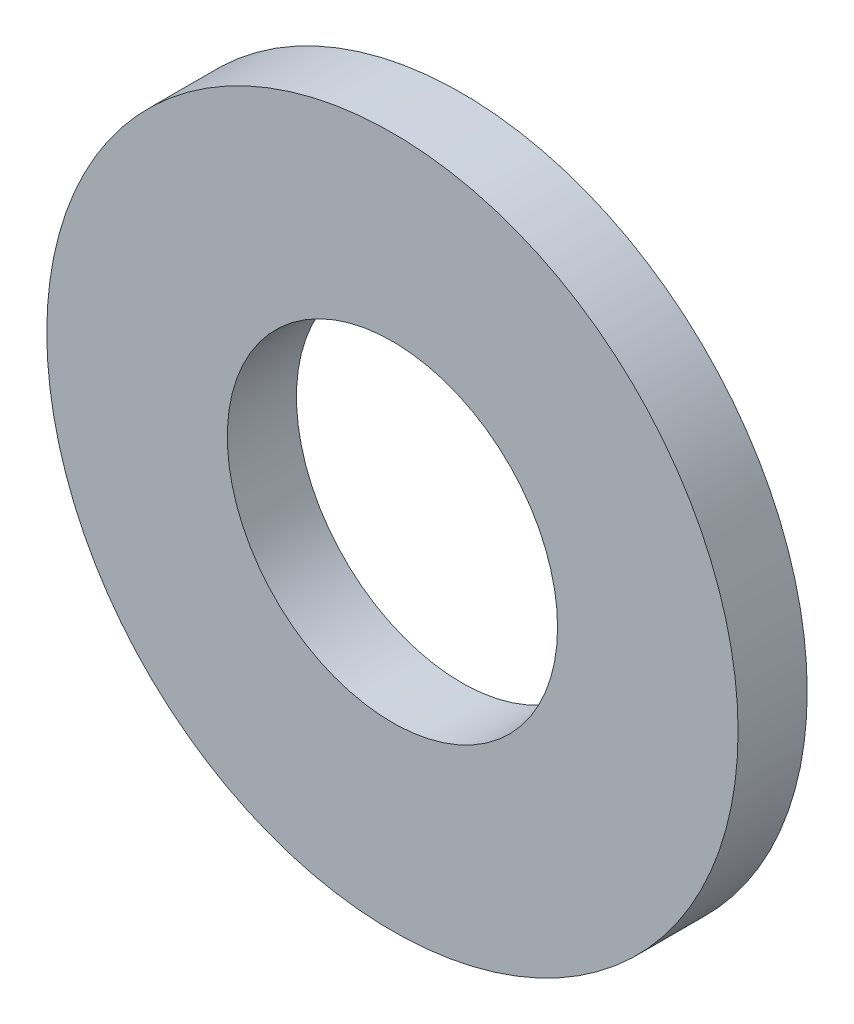
ISO-10303-21;
HEADER;
FILE_DESCRIPTION(('STEP AP214'),'2;1');
FILE_NAME('part.step','',(''),(''),'','','');
FILE_SCHEMA(('AUTOMOTIVE_DESIGN { 1 0 10303 214 1 1 1 1 }'));
ENDSEC;
DATA;
#1=APPLICATION_CONTEXT('core data for automotive mechanical design processes');
#2=APPLICATION_PROTOCOL_DEFINITION('international standard','automotive_design',2000,#1);
#3=PRODUCT_CONTEXT('',#1,'mechanical');
#4=PRODUCT('Part','Part','',(#3));
#5=PRODUCT_RELATED_PRODUCT_CATEGORY('part','',(#4));
#6=PRODUCT_DEFINITION_FORMATION('','',#4);
#7=PRODUCT_DEFINITION_CONTEXT('part definition',#1,'design');
#8=PRODUCT_DEFINITION('design','',#6,#7);
#9=PRODUCT_DEFINITION_SHAPE('','',#8);
#10=(LENGTH_UNIT() NAMED_UNIT(*) SI_UNIT(.MILLI.,.METRE.));
#11=(NAMED_UNIT(*) PLANE_ANGLE_UNIT() SI_UNIT($,.RADIAN.));
#12=(NAMED_UNIT(*) SI_UNIT($,.STERADIAN.) SOLID_ANGLE_UNIT());
#13=UNCERTAINTY_MEASURE_WITH_UNIT(LENGTH_MEASURE(1.E-05),#10,'distance_accuracy_value','');
#14=(GEOMETRIC_REPRESENTATION_CONTEXT(3) GLOBAL_UNCERTAINTY_ASSIGNED_CONTEXT((#13)) GLOBAL_UNIT_ASSIGNED_CONTEXT((#10,
#11,#12)) REPRESENTATION_CONTEXT('',''));
#15=CARTESIAN_POINT('',(0.,0.,0.));
#16=DIRECTION('',(0.,0.,1.));
#17=DIRECTION('',(1.,0.,0.));
#18=AXIS2_PLACEMENT_3D('',#15,#16,#17);
#19=CARTESIAN_POINT('',(0.,0.,0.9));
#20=DIRECTION('',(0.,0.,1.));
#21=DIRECTION('',(1.,0.,0.));
#22=AXIS2_PLACEMENT_3D('',#19,#20,#21);
#23=PLANE('',#22);
#24=CARTESIAN_POINT('',(0.,0.,0.9));
#25=DIRECTION('',(0.,0.,1.));
#26=DIRECTION('',(1.,0.,0.));
#27=AXIS2_PLACEMENT_3D('',#24,#25,#26);
#28=CIRCLE('',#27,4.5);
#29=CARTESIAN_POINT('',(4.5,0.,0.9));
#30=VERTEX_POINT('',#29);
#31=EDGE_CURVE('E10',#30,#30,#28,.T.);
#32=ORIENTED_EDGE('',*,*,#31,.T.);
#33=EDGE_LOOP('',(#32));
#34=FACE_BOUND('',#33,.T.);
#35=CARTESIAN_POINT('',(0.,0.,0.9));
#36=DIRECTION('',(0.,0.,1.));
#37=DIRECTION('',(1.,0.,0.));
#38=AXIS2_PLACEMENT_3D('',#35,#36,#37);
#39=CIRCLE('',#38,2.15);
#40=CARTESIAN_POINT('',(2.15,0.,0.9));
#41=VERTEX_POINT('',#40);
#42=EDGE_CURVE('E54',#41,#41,#39,.T.);
#43=ORIENTED_EDGE('',*,*,#42,.F.);
#44=EDGE_LOOP('',(#43));
#45=FACE_BOUND('',#44,.T.);
#46=ADVANCED_FACE('F40',(#34,#45),#23,.T.);
#47=CARTESIAN_POINT('',(0.,0.,0.));
#48=DIRECTION('',(0.,0.,1.));
#49=DIRECTION('',(1.,0.,0.));
#50=AXIS2_PLACEMENT_3D('',#47,#48,#49);
#51=PLANE('',#50);
#52=CARTESIAN_POINT('',(0.,0.,0.));
#53=DIRECTION('',(0.,0.,1.));
#54=DIRECTION('',(1.,0.,0.));
#55=AXIS2_PLACEMENT_3D('',#52,#53,#54);
#56=CIRCLE('',#55,4.5);
#57=CARTESIAN_POINT('',(4.5,0.,0.));
#58=VERTEX_POINT('',#57);
#59=EDGE_CURVE('E44',#58,#58,#56,.T.);
#60=ORIENTED_EDGE('',*,*,#59,.F.);
#61=EDGE_LOOP('',(#60));
#62=FACE_BOUND('',#61,.T.);
#63=CARTESIAN_POINT('',(0.,0.,0.));
#64=DIRECTION('',(0.,0.,1.));
#65=DIRECTION('',(1.,0.,0.));
#66=AXIS2_PLACEMENT_3D('',#63,#64,#65);
#67=CIRCLE('',#66,2.15);
#68=CARTESIAN_POINT('',(2.15,0.,0.));
#69=VERTEX_POINT('',#68);
#70=EDGE_CURVE('E56',#69,#69,#67,.T.);
#71=ORIENTED_EDGE('',*,*,#70,.T.);
#72=EDGE_LOOP('',(#71));
#73=FACE_BOUND('',#72,.T.);
#74=ADVANCED_FACE('F69',(#62,#73),#51,.F.);
#75=CARTESIAN_POINT('',(0.,0.,0.9));
#76=DIRECTION('',(0.,0.,-1.));
#77=DIRECTION('',(-1.,0.,0.));
#78=AXIS2_PLACEMENT_3D('',#75,#76,#77);
#79=CYLINDRICAL_SURFACE('',#78,4.5);
#80=ORIENTED_EDGE('',*,*,#31,.F.);
#81=EDGE_LOOP('',(#80));
#82=FACE_BOUND('',#81,.T.);
#83=ORIENTED_EDGE('',*,*,#59,.T.);
#84=EDGE_LOOP('',(#83));
#85=FACE_BOUND('',#84,.T.);
#86=ADVANCED_FACE('F42',(#82,#85),#79,.T.);
#87=CARTESIAN_POINT('',(0.,0.,0.9));
#88=DIRECTION('',(0.,0.,-1.));
#89=DIRECTION('',(-1.,0.,0.));
#90=AXIS2_PLACEMENT_3D('',#87,#88,#89);
#91=CYLINDRICAL_SURFACE('',#90,2.15);
#92=ORIENTED_EDGE('',*,*,#42,.T.);
#93=EDGE_LOOP('',(#92));
#94=FACE_BOUND('',#93,.T.);
#95=ORIENTED_EDGE('',*,*,#70,.F.);
#96=EDGE_LOOP('',(#95));
#97=FACE_BOUND('',#96,.T.);
#98=ADVANCED_FACE('F65',(#94,#97),#91,.F.);
#99=CLOSED_SHELL('',(#46,#74,#86,#98));
#100=MANIFOLD_SOLID_BREP('B2',#99);
#101=ADVANCED_BREP_SHAPE_REPRESENTATION('',(#18,#100),#14);
#102=SHAPE_DEFINITION_REPRESENTATION(#9,#101);
ENDSEC;
END-ISO-10303-21;
